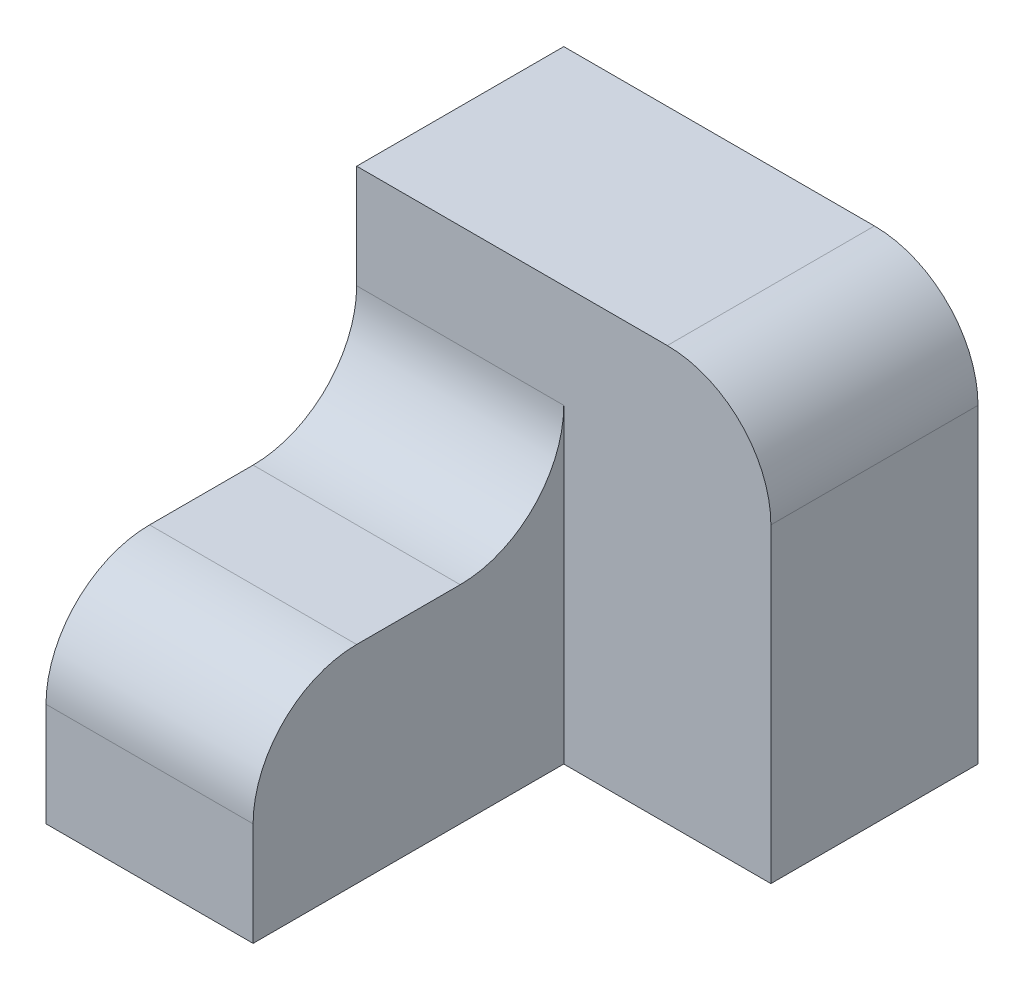
ISO-10303-21;
HEADER;
FILE_DESCRIPTION(('STEP AP214'),'2;1');
FILE_NAME('part.step','',(''),(''),'','','');
FILE_SCHEMA(('AUTOMOTIVE_DESIGN { 1 0 10303 214 1 1 1 1 }'));
ENDSEC;
DATA;
#1=APPLICATION_CONTEXT('core data for automotive mechanical design processes');
#2=APPLICATION_PROTOCOL_DEFINITION('international standard','automotive_design',2000,#1);
#3=PRODUCT_CONTEXT('',#1,'mechanical');
#4=PRODUCT('Part','Part','',(#3));
#5=PRODUCT_RELATED_PRODUCT_CATEGORY('part','',(#4));
#6=PRODUCT_DEFINITION_FORMATION('','',#4);
#7=PRODUCT_DEFINITION_CONTEXT('part definition',#1,'design');
#8=PRODUCT_DEFINITION('design','',#6,#7);
#9=PRODUCT_DEFINITION_SHAPE('','',#8);
#10=(LENGTH_UNIT() NAMED_UNIT(*) SI_UNIT(.MILLI.,.METRE.));
#11=(NAMED_UNIT(*) PLANE_ANGLE_UNIT() SI_UNIT($,.RADIAN.));
#12=(NAMED_UNIT(*) SI_UNIT($,.STERADIAN.) SOLID_ANGLE_UNIT());
#13=UNCERTAINTY_MEASURE_WITH_UNIT(LENGTH_MEASURE(1.E-05),#10,'distance_accuracy_value','');
#14=(GEOMETRIC_REPRESENTATION_CONTEXT(3) GLOBAL_UNCERTAINTY_ASSIGNED_CONTEXT((#13)) GLOBAL_UNIT_ASSIGNED_CONTEXT((#10,
#11,#12)) REPRESENTATION_CONTEXT('',''));
#15=CARTESIAN_POINT('',(0.,0.,0.));
#16=DIRECTION('',(0.,0.,1.));
#17=DIRECTION('',(1.,0.,0.));
#18=AXIS2_PLACEMENT_3D('',#15,#16,#17);
#19=CARTESIAN_POINT('',(-10.,0.,30.));
#20=DIRECTION('',(0.,-1.,0.));
#21=DIRECTION('',(1.,0.,0.));
#22=AXIS2_PLACEMENT_3D('',#19,#20,#21);
#23=PLANE('',#22);
#24=DIRECTION('',(0.,0.,-1.));
#25=VECTOR('',#24,1.);
#26=CARTESIAN_POINT('',(-10.,0.,30.));
#27=LINE('',#26,#25);
#28=CARTESIAN_POINT('',(-10.,0.,20.));
#29=VERTEX_POINT('',#28);
#30=CARTESIAN_POINT('',(-10.,0.,10.));
#31=VERTEX_POINT('',#30);
#32=EDGE_CURVE('E164',#29,#31,#27,.T.);
#33=ORIENTED_EDGE('',*,*,#32,.T.);
#34=DIRECTION('',(-1.,0.,0.));
#35=VECTOR('',#34,1.);
#36=CARTESIAN_POINT('',(-10.,0.,10.));
#37=LINE('',#36,#35);
#38=CARTESIAN_POINT('',(-30.,0.,10.));
#39=VERTEX_POINT('',#38);
#40=EDGE_CURVE('E178',#31,#39,#37,.T.);
#41=ORIENTED_EDGE('',*,*,#40,.T.);
#42=DIRECTION('',(0.,0.,-1.));
#43=VECTOR('',#42,1.);
#44=CARTESIAN_POINT('',(-30.,0.,30.));
#45=LINE('',#44,#43);
#46=CARTESIAN_POINT('',(-30.,0.,20.));
#47=VERTEX_POINT('',#46);
#48=EDGE_CURVE('E173',#47,#39,#45,.T.);
#49=ORIENTED_EDGE('',*,*,#48,.F.);
#50=DIRECTION('',(-1.,0.,0.));
#51=VECTOR('',#50,1.);
#52=CARTESIAN_POINT('',(-10.,0.,20.));
#53=LINE('',#52,#51);
#54=EDGE_CURVE('E176',#47,#29,#53,.F.);
#55=ORIENTED_EDGE('',*,*,#54,.T.);
#56=EDGE_LOOP('',(#33,#41,#49,#55));
#57=FACE_BOUND('',#56,.T.);
#58=ADVANCED_FACE('F35',(#57),#23,.F.);
#59=CARTESIAN_POINT('',(-30.,0.,30.));
#60=DIRECTION('',(1.,0.,0.));
#61=DIRECTION('',(0.,0.,-1.));
#62=AXIS2_PLACEMENT_3D('',#59,#60,#61);
#63=PLANE('',#62);
#64=DIRECTION('',(0.,-1.,0.));
#65=VECTOR('',#64,1.);
#66=CARTESIAN_POINT('',(-30.,0.,30.));
#67=LINE('',#66,#65);
#68=CARTESIAN_POINT('',(-30.,-10.,30.));
#69=VERTEX_POINT('',#68);
#70=CARTESIAN_POINT('',(-30.,-20.,30.));
#71=VERTEX_POINT('',#70);
#72=EDGE_CURVE('E158',#69,#71,#67,.T.);
#73=ORIENTED_EDGE('',*,*,#72,.F.);
#74=CARTESIAN_POINT('',(-30.,-10.,20.));
#75=DIRECTION('',(1.,0.,0.));
#76=DIRECTION('',(0.,0.,-1.));
#77=AXIS2_PLACEMENT_3D('',#74,#75,#76);
#78=CIRCLE('',#77,10.);
#79=EDGE_CURVE('E58',#69,#47,#78,.F.);
#80=ORIENTED_EDGE('',*,*,#79,.T.);
#81=ORIENTED_EDGE('',*,*,#48,.T.);
#82=CARTESIAN_POINT('',(-30.,10.,10.));
#83=DIRECTION('',(1.,0.,0.));
#84=DIRECTION('',(0.,0.,-1.));
#85=AXIS2_PLACEMENT_3D('',#82,#83,#84);
#86=CIRCLE('',#85,10.);
#87=CARTESIAN_POINT('',(-30.,10.,0.));
#88=VERTEX_POINT('',#87);
#89=EDGE_CURVE('E43',#39,#88,#86,.T.);
#90=ORIENTED_EDGE('',*,*,#89,.T.);
#91=DIRECTION('',(0.,-1.,0.));
#92=VECTOR('',#91,1.);
#93=CARTESIAN_POINT('',(-30.,20.,0.));
#94=LINE('',#93,#92);
#95=CARTESIAN_POINT('',(-30.,20.,0.));
#96=VERTEX_POINT('',#95);
#97=EDGE_CURVE('E134',#96,#88,#94,.T.);
#98=ORIENTED_EDGE('',*,*,#97,.F.);
#99=DIRECTION('',(0.,0.,1.));
#100=VECTOR('',#99,1.);
#101=CARTESIAN_POINT('',(-30.,20.,-20.));
#102=LINE('',#101,#100);
#103=CARTESIAN_POINT('',(-30.,20.,-20.));
#104=VERTEX_POINT('',#103);
#105=EDGE_CURVE('E118',#104,#96,#102,.T.);
#106=ORIENTED_EDGE('',*,*,#105,.F.);
#107=DIRECTION('',(0.,-1.,0.));
#108=VECTOR('',#107,1.);
#109=CARTESIAN_POINT('',(-30.,20.,-20.));
#110=LINE('',#109,#108);
#111=CARTESIAN_POINT('',(-30.,-20.,-20.));
#112=VERTEX_POINT('',#111);
#113=EDGE_CURVE('E125',#104,#112,#110,.T.);
#114=ORIENTED_EDGE('',*,*,#113,.T.);
#115=DIRECTION('',(0.,0.,-1.));
#116=VECTOR('',#115,1.);
#117=CARTESIAN_POINT('',(-30.,-20.,30.));
#118=LINE('',#117,#116);
#119=EDGE_CURVE('E171',#71,#112,#118,.T.);
#120=ORIENTED_EDGE('',*,*,#119,.F.);
#121=EDGE_LOOP('',(#73,#80,#81,#90,#98,#106,#114,#120));
#122=FACE_BOUND('',#121,.T.);
#123=ADVANCED_FACE('F131',(#122),#63,.F.);
#124=CARTESIAN_POINT('',(-30.,-20.,30.));
#125=DIRECTION('',(0.,1.,0.));
#126=DIRECTION('',(0.,0.,1.));
#127=AXIS2_PLACEMENT_3D('',#124,#125,#126);
#128=PLANE('',#127);
#129=ORIENTED_EDGE('',*,*,#119,.T.);
#130=DIRECTION('',(1.,0.,0.));
#131=VECTOR('',#130,1.);
#132=CARTESIAN_POINT('',(-30.,-20.,-20.));
#133=LINE('',#132,#131);
#134=CARTESIAN_POINT('',(10.,-20.,-20.));
#135=VERTEX_POINT('',#134);
#136=EDGE_CURVE('E142',#112,#135,#133,.T.);
#137=ORIENTED_EDGE('',*,*,#136,.T.);
#138=DIRECTION('',(0.,0.,1.));
#139=VECTOR('',#138,1.);
#140=CARTESIAN_POINT('',(10.,-20.,-20.));
#141=LINE('',#140,#139);
#142=CARTESIAN_POINT('',(10.,-20.,0.));
#143=VERTEX_POINT('',#142);
#144=EDGE_CURVE('E135',#135,#143,#141,.T.);
#145=ORIENTED_EDGE('',*,*,#144,.T.);
#146=DIRECTION('',(1.,0.,0.));
#147=VECTOR('',#146,1.);
#148=CARTESIAN_POINT('',(-30.,-20.,0.));
#149=LINE('',#148,#147);
#150=CARTESIAN_POINT('',(-10.,-20.,0.));
#151=VERTEX_POINT('',#150);
#152=EDGE_CURVE('E151',#151,#143,#149,.T.);
#153=ORIENTED_EDGE('',*,*,#152,.F.);
#154=DIRECTION('',(0.,0.,-1.));
#155=VECTOR('',#154,1.);
#156=CARTESIAN_POINT('',(-10.,-20.,30.));
#157=LINE('',#156,#155);
#158=CARTESIAN_POINT('',(-10.,-20.,30.));
#159=VERTEX_POINT('',#158);
#160=EDGE_CURVE('E168',#159,#151,#157,.T.);
#161=ORIENTED_EDGE('',*,*,#160,.F.);
#162=DIRECTION('',(1.,0.,0.));
#163=VECTOR('',#162,1.);
#164=CARTESIAN_POINT('',(-30.,-20.,30.));
#165=LINE('',#164,#163);
#166=EDGE_CURVE('E160',#71,#159,#165,.T.);
#167=ORIENTED_EDGE('',*,*,#166,.F.);
#168=EDGE_LOOP('',(#129,#137,#145,#153,#161,#167));
#169=FACE_BOUND('',#168,.T.);
#170=ADVANCED_FACE('F210',(#169),#128,.F.);
#171=CARTESIAN_POINT('',(-10.,-20.,30.));
#172=DIRECTION('',(-1.,0.,0.));
#173=DIRECTION('',(0.,0.,1.));
#174=AXIS2_PLACEMENT_3D('',#171,#172,#173);
#175=PLANE('',#174);
#176=ORIENTED_EDGE('',*,*,#32,.F.);
#177=CARTESIAN_POINT('',(-10.,-10.,20.));
#178=DIRECTION('',(-1.,0.,0.));
#179=DIRECTION('',(0.,0.,1.));
#180=AXIS2_PLACEMENT_3D('',#177,#178,#179);
#181=CIRCLE('',#180,10.);
#182=CARTESIAN_POINT('',(-10.,-10.,30.));
#183=VERTEX_POINT('',#182);
#184=EDGE_CURVE('E50',#29,#183,#181,.F.);
#185=ORIENTED_EDGE('',*,*,#184,.T.);
#186=DIRECTION('',(0.,1.,0.));
#187=VECTOR('',#186,1.);
#188=CARTESIAN_POINT('',(-10.,-20.,30.));
#189=LINE('',#188,#187);
#190=EDGE_CURVE('E162',#159,#183,#189,.T.);
#191=ORIENTED_EDGE('',*,*,#190,.F.);
#192=ORIENTED_EDGE('',*,*,#160,.T.);
#193=DIRECTION('',(0.,1.,0.));
#194=VECTOR('',#193,1.);
#195=CARTESIAN_POINT('',(-10.,-20.,0.));
#196=LINE('',#195,#194);
#197=CARTESIAN_POINT('',(-10.,10.,0.));
#198=VERTEX_POINT('',#197);
#199=EDGE_CURVE('E156',#151,#198,#196,.T.);
#200=ORIENTED_EDGE('',*,*,#199,.T.);
#201=CARTESIAN_POINT('',(-10.,10.,10.));
#202=DIRECTION('',(-1.,0.,0.));
#203=DIRECTION('',(0.,0.,1.));
#204=AXIS2_PLACEMENT_3D('',#201,#202,#203);
#205=CIRCLE('',#204,10.);
#206=EDGE_CURVE('E11',#198,#31,#205,.T.);
#207=ORIENTED_EDGE('',*,*,#206,.T.);
#208=EDGE_LOOP('',(#176,#185,#191,#192,#200,#207));
#209=FACE_BOUND('',#208,.T.);
#210=ADVANCED_FACE('F203',(#209),#175,.F.);
#211=CARTESIAN_POINT('',(0.,0.,30.));
#212=DIRECTION('',(0.,0.,1.));
#213=DIRECTION('',(1.,0.,0.));
#214=AXIS2_PLACEMENT_3D('',#211,#212,#213);
#215=PLANE('',#214);
#216=ORIENTED_EDGE('',*,*,#190,.T.);
#217=DIRECTION('',(-1.,0.,0.));
#218=VECTOR('',#217,1.);
#219=CARTESIAN_POINT('',(-30.,-10.,30.));
#220=LINE('',#219,#218);
#221=EDGE_CURVE('E192',#183,#69,#220,.T.);
#222=ORIENTED_EDGE('',*,*,#221,.T.);
#223=ORIENTED_EDGE('',*,*,#72,.T.);
#224=ORIENTED_EDGE('',*,*,#166,.T.);
#225=EDGE_LOOP('',(#216,#222,#223,#224));
#226=FACE_BOUND('',#225,.T.);
#227=ADVANCED_FACE('F206',(#226),#215,.T.);
#228=CARTESIAN_POINT('',(0.,0.,0.));
#229=DIRECTION('',(0.,0.,1.));
#230=DIRECTION('',(1.,0.,0.));
#231=AXIS2_PLACEMENT_3D('',#228,#229,#230);
#232=PLANE('',#231);
#233=ORIENTED_EDGE('',*,*,#97,.T.);
#234=DIRECTION('',(-1.,0.,0.));
#235=VECTOR('',#234,1.);
#236=CARTESIAN_POINT('',(0.,10.,0.));
#237=LINE('',#236,#235);
#238=EDGE_CURVE('E183',#88,#198,#237,.F.);
#239=ORIENTED_EDGE('',*,*,#238,.T.);
#240=ORIENTED_EDGE('',*,*,#199,.F.);
#241=ORIENTED_EDGE('',*,*,#152,.T.);
#242=DIRECTION('',(0.,1.,0.));
#243=VECTOR('',#242,1.);
#244=CARTESIAN_POINT('',(10.,-20.,0.));
#245=LINE('',#244,#243);
#246=CARTESIAN_POINT('',(10.,10.,0.));
#247=VERTEX_POINT('',#246);
#248=EDGE_CURVE('E126',#143,#247,#245,.T.);
#249=ORIENTED_EDGE('',*,*,#248,.T.);
#250=CARTESIAN_POINT('',(0.,10.,0.));
#251=DIRECTION('',(0.,0.,1.));
#252=DIRECTION('',(1.,0.,0.));
#253=AXIS2_PLACEMENT_3D('',#250,#251,#252);
#254=CIRCLE('',#253,10.);
#255=CARTESIAN_POINT('',(0.,20.,0.));
#256=VERTEX_POINT('',#255);
#257=EDGE_CURVE('E181',#247,#256,#254,.T.);
#258=ORIENTED_EDGE('',*,*,#257,.T.);
#259=DIRECTION('',(-1.,0.,0.));
#260=VECTOR('',#259,1.);
#261=CARTESIAN_POINT('',(10.,20.,0.));
#262=LINE('',#261,#260);
#263=EDGE_CURVE('E148',#256,#96,#262,.T.);
#264=ORIENTED_EDGE('',*,*,#263,.T.);
#265=EDGE_LOOP('',(#233,#239,#240,#241,#249,#258,#264));
#266=FACE_BOUND('',#265,.T.);
#267=ADVANCED_FACE('F200',(#266),#232,.T.);
#268=CARTESIAN_POINT('',(10.,20.,-20.));
#269=DIRECTION('',(0.,1.,0.));
#270=DIRECTION('',(-1.,0.,0.));
#271=AXIS2_PLACEMENT_3D('',#268,#269,#270);
#272=PLANE('',#271);
#273=ORIENTED_EDGE('',*,*,#263,.F.);
#274=DIRECTION('',(0.,0.,1.));
#275=VECTOR('',#274,1.);
#276=CARTESIAN_POINT('',(0.,20.,-20.));
#277=LINE('',#276,#275);
#278=CARTESIAN_POINT('',(0.,20.,-20.));
#279=VERTEX_POINT('',#278);
#280=EDGE_CURVE('E121',#256,#279,#277,.F.);
#281=ORIENTED_EDGE('',*,*,#280,.T.);
#282=DIRECTION('',(-1.,0.,0.));
#283=VECTOR('',#282,1.);
#284=CARTESIAN_POINT('',(10.,20.,-20.));
#285=LINE('',#284,#283);
#286=EDGE_CURVE('E114',#279,#104,#285,.T.);
#287=ORIENTED_EDGE('',*,*,#286,.T.);
#288=ORIENTED_EDGE('',*,*,#105,.T.);
#289=EDGE_LOOP('',(#273,#281,#287,#288));
#290=FACE_BOUND('',#289,.T.);
#291=ADVANCED_FACE('F117',(#290),#272,.T.);
#292=CARTESIAN_POINT('',(10.,-20.,-20.));
#293=DIRECTION('',(1.,0.,0.));
#294=DIRECTION('',(0.,0.,-1.));
#295=AXIS2_PLACEMENT_3D('',#292,#293,#294);
#296=PLANE('',#295);
#297=DIRECTION('',(0.,1.,0.));
#298=VECTOR('',#297,1.);
#299=CARTESIAN_POINT('',(10.,-20.,-20.));
#300=LINE('',#299,#298);
#301=CARTESIAN_POINT('',(10.,10.,-20.));
#302=VERTEX_POINT('',#301);
#303=EDGE_CURVE('E136',#135,#302,#300,.T.);
#304=ORIENTED_EDGE('',*,*,#303,.T.);
#305=DIRECTION('',(0.,0.,1.));
#306=VECTOR('',#305,1.);
#307=CARTESIAN_POINT('',(10.,10.,-20.));
#308=LINE('',#307,#306);
#309=EDGE_CURVE('E186',#302,#247,#308,.T.);
#310=ORIENTED_EDGE('',*,*,#309,.T.);
#311=ORIENTED_EDGE('',*,*,#248,.F.);
#312=ORIENTED_EDGE('',*,*,#144,.F.);
#313=EDGE_LOOP('',(#304,#310,#311,#312));
#314=FACE_BOUND('',#313,.T.);
#315=ADVANCED_FACE('F214',(#314),#296,.T.);
#316=CARTESIAN_POINT('',(0.,0.,-20.));
#317=DIRECTION('',(0.,0.,1.));
#318=DIRECTION('',(1.,0.,0.));
#319=AXIS2_PLACEMENT_3D('',#316,#317,#318);
#320=PLANE('',#319);
#321=ORIENTED_EDGE('',*,*,#286,.F.);
#322=CARTESIAN_POINT('',(0.,10.,-20.));
#323=DIRECTION('',(0.,0.,1.));
#324=DIRECTION('',(1.,0.,0.));
#325=AXIS2_PLACEMENT_3D('',#322,#323,#324);
#326=CIRCLE('',#325,10.);
#327=EDGE_CURVE('E190',#279,#302,#326,.F.);
#328=ORIENTED_EDGE('',*,*,#327,.T.);
#329=ORIENTED_EDGE('',*,*,#303,.F.);
#330=ORIENTED_EDGE('',*,*,#136,.F.);
#331=ORIENTED_EDGE('',*,*,#113,.F.);
#332=EDGE_LOOP('',(#321,#328,#329,#330,#331));
#333=FACE_BOUND('',#332,.T.);
#334=ADVANCED_FACE('F139',(#333),#320,.F.);
#335=CARTESIAN_POINT('',(-10.,10.,10.));
#336=DIRECTION('',(-1.,0.,0.));
#337=DIRECTION('',(0.,-1.,0.));
#338=AXIS2_PLACEMENT_3D('',#335,#336,#337);
#339=CYLINDRICAL_SURFACE('',#338,10.);
#340=ORIENTED_EDGE('',*,*,#206,.F.);
#341=ORIENTED_EDGE('',*,*,#238,.F.);
#342=ORIENTED_EDGE('',*,*,#89,.F.);
#343=ORIENTED_EDGE('',*,*,#40,.F.);
#344=EDGE_LOOP('',(#340,#341,#342,#343));
#345=FACE_BOUND('',#344,.T.);
#346=ADVANCED_FACE('F202',(#345),#339,.F.);
#347=CARTESIAN_POINT('',(0.,10.,-20.));
#348=DIRECTION('',(0.,0.,1.));
#349=DIRECTION('',(1.,0.,0.));
#350=AXIS2_PLACEMENT_3D('',#347,#348,#349);
#351=CYLINDRICAL_SURFACE('',#350,10.);
#352=ORIENTED_EDGE('',*,*,#327,.F.);
#353=ORIENTED_EDGE('',*,*,#280,.F.);
#354=ORIENTED_EDGE('',*,*,#257,.F.);
#355=ORIENTED_EDGE('',*,*,#309,.F.);
#356=EDGE_LOOP('',(#352,#353,#354,#355));
#357=FACE_BOUND('',#356,.T.);
#358=ADVANCED_FACE('F217',(#357),#351,.T.);
#359=CARTESIAN_POINT('',(0.,-10.,20.));
#360=DIRECTION('',(1.,0.,0.));
#361=DIRECTION('',(0.,1.,0.));
#362=AXIS2_PLACEMENT_3D('',#359,#360,#361);
#363=CYLINDRICAL_SURFACE('',#362,10.);
#364=ORIENTED_EDGE('',*,*,#184,.F.);
#365=ORIENTED_EDGE('',*,*,#54,.F.);
#366=ORIENTED_EDGE('',*,*,#79,.F.);
#367=ORIENTED_EDGE('',*,*,#221,.F.);
#368=EDGE_LOOP('',(#364,#365,#366,#367));
#369=FACE_BOUND('',#368,.T.);
#370=ADVANCED_FACE('F37',(#369),#363,.T.);
#371=CLOSED_SHELL('',(#58,#123,#170,#210,#227,#267,#291,#315,#334,#346,#358,#370));
#372=MANIFOLD_SOLID_BREP('B2',#371);
#373=ADVANCED_BREP_SHAPE_REPRESENTATION('',(#18,#372),#14);
#374=SHAPE_DEFINITION_REPRESENTATION(#9,#373);
ENDSEC;
END-ISO-10303-21;
